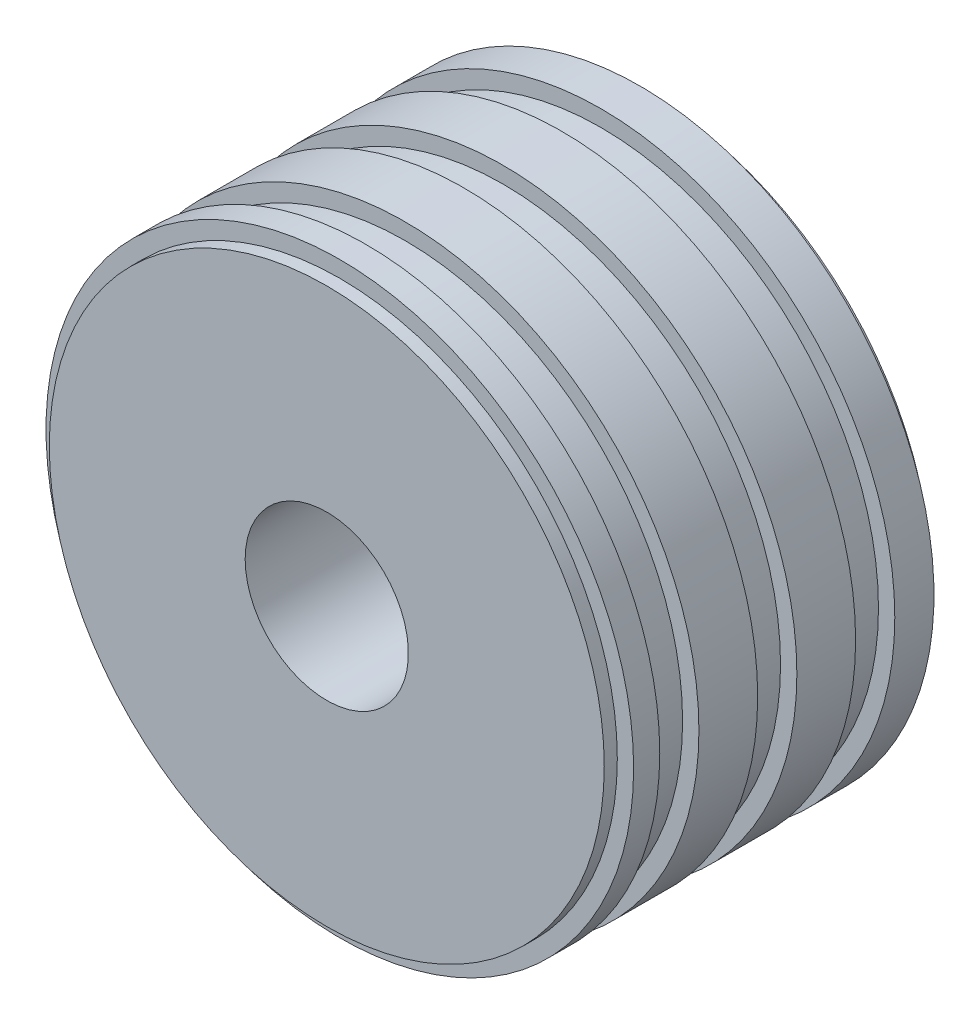
ISO-10303-21;
HEADER;
FILE_DESCRIPTION(('STEP AP214'),'2;1');
FILE_NAME('part.step','',(''),(''),'','','');
FILE_SCHEMA(('AUTOMOTIVE_DESIGN { 1 0 10303 214 1 1 1 1 }'));
ENDSEC;
DATA;
#1=APPLICATION_CONTEXT('core data for automotive mechanical design processes');
#2=APPLICATION_PROTOCOL_DEFINITION('international standard','automotive_design',2000,#1);
#3=PRODUCT_CONTEXT('',#1,'mechanical');
#4=PRODUCT('Part','Part','',(#3));
#5=PRODUCT_RELATED_PRODUCT_CATEGORY('part','',(#4));
#6=PRODUCT_DEFINITION_FORMATION('','',#4);
#7=PRODUCT_DEFINITION_CONTEXT('part definition',#1,'design');
#8=PRODUCT_DEFINITION('design','',#6,#7);
#9=PRODUCT_DEFINITION_SHAPE('','',#8);
#10=(LENGTH_UNIT() NAMED_UNIT(*) SI_UNIT(.MILLI.,.METRE.));
#11=(NAMED_UNIT(*) PLANE_ANGLE_UNIT() SI_UNIT($,.RADIAN.));
#12=(NAMED_UNIT(*) SI_UNIT($,.STERADIAN.) SOLID_ANGLE_UNIT());
#13=UNCERTAINTY_MEASURE_WITH_UNIT(LENGTH_MEASURE(1.E-05),#10,'distance_accuracy_value','');
#14=(GEOMETRIC_REPRESENTATION_CONTEXT(3) GLOBAL_UNCERTAINTY_ASSIGNED_CONTEXT((#13)) GLOBAL_UNIT_ASSIGNED_CONTEXT((#10,
#11,#12)) REPRESENTATION_CONTEXT('',''));
#15=CARTESIAN_POINT('',(0.,0.,0.));
#16=DIRECTION('',(0.,0.,1.));
#17=DIRECTION('',(1.,0.,0.));
#18=AXIS2_PLACEMENT_3D('',#15,#16,#17);
#19=CARTESIAN_POINT('',(0.,0.,50.));
#20=DIRECTION('',(0.,0.,-1.));
#21=DIRECTION('',(-1.,0.,0.));
#22=AXIS2_PLACEMENT_3D('',#19,#20,#21);
#23=CYLINDRICAL_SURFACE('',#22,45.);
#24=CARTESIAN_POINT('',(0.,0.,8.));
#25=DIRECTION('',(0.,0.,1.));
#26=DIRECTION('',(1.,0.,0.));
#27=AXIS2_PLACEMENT_3D('',#24,#25,#26);
#28=CIRCLE('',#27,45.);
#29=CARTESIAN_POINT('',(45.,0.,8.));
#30=VERTEX_POINT('',#29);
#31=EDGE_CURVE('E63',#30,#30,#28,.T.);
#32=ORIENTED_EDGE('',*,*,#31,.F.);
#33=EDGE_LOOP('',(#32));
#34=FACE_BOUND('',#33,.T.);
#35=CARTESIAN_POINT('',(0.,0.,2.));
#36=DIRECTION('',(0.,0.,-1.));
#37=DIRECTION('',(-1.,0.,0.));
#38=AXIS2_PLACEMENT_3D('',#35,#36,#37);
#39=CIRCLE('',#38,45.);
#40=CARTESIAN_POINT('',(-45.,0.,2.));
#41=VERTEX_POINT('',#40);
#42=EDGE_CURVE('E90',#41,#41,#39,.T.);
#43=ORIENTED_EDGE('',*,*,#42,.F.);
#44=EDGE_LOOP('',(#43));
#45=FACE_BOUND('',#44,.T.);
#46=ADVANCED_FACE('F41',(#34,#45),#23,.T.);
#47=CARTESIAN_POINT('',(0.,0.,44.));
#48=DIRECTION('',(0.,0.,1.));
#49=DIRECTION('',(1.,0.,0.));
#50=AXIS2_PLACEMENT_3D('',#47,#48,#49);
#51=CIRCLE('',#50,45.);
#52=CARTESIAN_POINT('',(45.,0.,44.));
#53=VERTEX_POINT('',#52);
#54=EDGE_CURVE('E45',#53,#53,#51,.T.);
#55=ORIENTED_EDGE('',*,*,#54,.T.);
#56=EDGE_LOOP('',(#55));
#57=FACE_BOUND('',#56,.T.);
#58=CARTESIAN_POINT('',(0.,0.,48.));
#59=DIRECTION('',(0.,0.,1.));
#60=DIRECTION('',(1.,0.,0.));
#61=AXIS2_PLACEMENT_3D('',#58,#59,#60);
#62=CIRCLE('',#61,45.);
#63=CARTESIAN_POINT('',(45.,0.,48.));
#64=VERTEX_POINT('',#63);
#65=EDGE_CURVE('E71',#64,#64,#62,.T.);
#66=ORIENTED_EDGE('',*,*,#65,.F.);
#67=EDGE_LOOP('',(#66));
#68=FACE_BOUND('',#67,.T.);
#69=ADVANCED_FACE('F43',(#57,#68),#23,.T.);
#70=CARTESIAN_POINT('',(0.,0.,29.));
#71=DIRECTION('',(0.,0.,1.));
#72=DIRECTION('',(1.,0.,0.));
#73=AXIS2_PLACEMENT_3D('',#70,#71,#72);
#74=CIRCLE('',#73,45.);
#75=CARTESIAN_POINT('',(45.,0.,29.));
#76=VERTEX_POINT('',#75);
#77=EDGE_CURVE('E74',#76,#76,#74,.T.);
#78=ORIENTED_EDGE('',*,*,#77,.T.);
#79=EDGE_LOOP('',(#78));
#80=FACE_BOUND('',#79,.T.);
#81=CARTESIAN_POINT('',(0.,0.,38.));
#82=DIRECTION('',(0.,0.,1.));
#83=DIRECTION('',(1.,0.,0.));
#84=AXIS2_PLACEMENT_3D('',#81,#82,#83);
#85=CIRCLE('',#84,45.);
#86=CARTESIAN_POINT('',(45.,0.,38.));
#87=VERTEX_POINT('',#86);
#88=EDGE_CURVE('E10',#87,#87,#85,.T.);
#89=ORIENTED_EDGE('',*,*,#88,.F.);
#90=EDGE_LOOP('',(#89));
#91=FACE_BOUND('',#90,.T.);
#92=ADVANCED_FACE('F140',(#80,#91),#23,.T.);
#93=CARTESIAN_POINT('',(0.,0.,38.));
#94=DIRECTION('',(0.,0.,1.));
#95=DIRECTION('',(1.,0.,0.));
#96=AXIS2_PLACEMENT_3D('',#93,#94,#95);
#97=PLANE('',#96);
#98=CARTESIAN_POINT('',(0.,0.,38.));
#99=DIRECTION('',(0.,0.,1.));
#100=DIRECTION('',(1.,0.,0.));
#101=AXIS2_PLACEMENT_3D('',#98,#99,#100);
#102=CIRCLE('',#101,42.5);
#103=CARTESIAN_POINT('',(42.5,0.,38.));
#104=VERTEX_POINT('',#103);
#105=EDGE_CURVE('E52',#104,#104,#102,.T.);
#106=ORIENTED_EDGE('',*,*,#105,.F.);
#107=EDGE_LOOP('',(#106));
#108=FACE_BOUND('',#107,.T.);
#109=ORIENTED_EDGE('',*,*,#88,.T.);
#110=EDGE_LOOP('',(#109));
#111=FACE_BOUND('',#110,.T.);
#112=ADVANCED_FACE('F160',(#108,#111),#97,.T.);
#113=CARTESIAN_POINT('',(0.,0.,44.));
#114=DIRECTION('',(0.,0.,1.));
#115=DIRECTION('',(1.,0.,0.));
#116=AXIS2_PLACEMENT_3D('',#113,#114,#115);
#117=PLANE('',#116);
#118=CARTESIAN_POINT('',(0.,0.,44.));
#119=DIRECTION('',(0.,0.,1.));
#120=DIRECTION('',(1.,0.,0.));
#121=AXIS2_PLACEMENT_3D('',#118,#119,#120);
#122=CIRCLE('',#121,42.5);
#123=CARTESIAN_POINT('',(42.5,0.,44.));
#124=VERTEX_POINT('',#123);
#125=EDGE_CURVE('E54',#124,#124,#122,.T.);
#126=ORIENTED_EDGE('',*,*,#125,.T.);
#127=EDGE_LOOP('',(#126));
#128=FACE_BOUND('',#127,.T.);
#129=ORIENTED_EDGE('',*,*,#54,.F.);
#130=EDGE_LOOP('',(#129));
#131=FACE_BOUND('',#130,.T.);
#132=ADVANCED_FACE('F167',(#128,#131),#117,.F.);
#133=CARTESIAN_POINT('',(0.,0.,38.));
#134=DIRECTION('',(0.,0.,1.));
#135=DIRECTION('',(1.,0.,0.));
#136=AXIS2_PLACEMENT_3D('',#133,#134,#135);
#137=CYLINDRICAL_SURFACE('',#136,42.5);
#138=ORIENTED_EDGE('',*,*,#105,.T.);
#139=EDGE_LOOP('',(#138));
#140=FACE_BOUND('',#139,.T.);
#141=ORIENTED_EDGE('',*,*,#125,.F.);
#142=EDGE_LOOP('',(#141));
#143=FACE_BOUND('',#142,.T.);
#144=ADVANCED_FACE('F179',(#140,#143),#137,.T.);
#145=CARTESIAN_POINT('',(0.,0.,23.));
#146=DIRECTION('',(0.,0.,1.));
#147=DIRECTION('',(1.,0.,0.));
#148=AXIS2_PLACEMENT_3D('',#145,#146,#147);
#149=PLANE('',#148);
#150=CARTESIAN_POINT('',(0.,0.,23.));
#151=DIRECTION('',(0.,0.,1.));
#152=DIRECTION('',(1.,0.,0.));
#153=AXIS2_PLACEMENT_3D('',#150,#151,#152);
#154=CIRCLE('',#153,42.5);
#155=CARTESIAN_POINT('',(42.5,0.,23.));
#156=VERTEX_POINT('',#155);
#157=EDGE_CURVE('E77',#156,#156,#154,.T.);
#158=ORIENTED_EDGE('',*,*,#157,.F.);
#159=EDGE_LOOP('',(#158));
#160=FACE_BOUND('',#159,.T.);
#161=CARTESIAN_POINT('',(0.,0.,23.));
#162=DIRECTION('',(0.,0.,1.));
#163=DIRECTION('',(1.,0.,0.));
#164=AXIS2_PLACEMENT_3D('',#161,#162,#163);
#165=CIRCLE('',#164,45.);
#166=CARTESIAN_POINT('',(45.,0.,23.));
#167=VERTEX_POINT('',#166);
#168=EDGE_CURVE('E57',#167,#167,#165,.T.);
#169=ORIENTED_EDGE('',*,*,#168,.T.);
#170=EDGE_LOOP('',(#169));
#171=FACE_BOUND('',#170,.T.);
#172=ADVANCED_FACE('F174',(#160,#171),#149,.T.);
#173=CARTESIAN_POINT('',(0.,0.,29.));
#174=DIRECTION('',(0.,0.,1.));
#175=DIRECTION('',(1.,0.,0.));
#176=AXIS2_PLACEMENT_3D('',#173,#174,#175);
#177=PLANE('',#176);
#178=CARTESIAN_POINT('',(0.,0.,29.));
#179=DIRECTION('',(0.,0.,1.));
#180=DIRECTION('',(1.,0.,0.));
#181=AXIS2_PLACEMENT_3D('',#178,#179,#180);
#182=CIRCLE('',#181,42.5);
#183=CARTESIAN_POINT('',(42.5,0.,29.));
#184=VERTEX_POINT('',#183);
#185=EDGE_CURVE('E67',#184,#184,#182,.T.);
#186=ORIENTED_EDGE('',*,*,#185,.T.);
#187=EDGE_LOOP('',(#186));
#188=FACE_BOUND('',#187,.T.);
#189=ORIENTED_EDGE('',*,*,#77,.F.);
#190=EDGE_LOOP('',(#189));
#191=FACE_BOUND('',#190,.T.);
#192=ADVANCED_FACE('F155',(#188,#191),#177,.F.);
#193=CARTESIAN_POINT('',(0.,0.,23.));
#194=DIRECTION('',(0.,0.,1.));
#195=DIRECTION('',(1.,0.,0.));
#196=AXIS2_PLACEMENT_3D('',#193,#194,#195);
#197=CYLINDRICAL_SURFACE('',#196,42.5);
#198=ORIENTED_EDGE('',*,*,#157,.T.);
#199=EDGE_LOOP('',(#198));
#200=FACE_BOUND('',#199,.T.);
#201=ORIENTED_EDGE('',*,*,#185,.F.);
#202=EDGE_LOOP('',(#201));
#203=FACE_BOUND('',#202,.T.);
#204=ADVANCED_FACE('F146',(#200,#203),#197,.T.);
#205=CARTESIAN_POINT('',(0.,0.,14.));
#206=DIRECTION('',(0.,0.,1.));
#207=DIRECTION('',(1.,0.,0.));
#208=AXIS2_PLACEMENT_3D('',#205,#206,#207);
#209=CIRCLE('',#208,45.);
#210=CARTESIAN_POINT('',(45.,0.,14.));
#211=VERTEX_POINT('',#210);
#212=EDGE_CURVE('E60',#211,#211,#209,.T.);
#213=ORIENTED_EDGE('',*,*,#212,.T.);
#214=EDGE_LOOP('',(#213));
#215=FACE_BOUND('',#214,.T.);
#216=ORIENTED_EDGE('',*,*,#168,.F.);
#217=EDGE_LOOP('',(#216));
#218=FACE_BOUND('',#217,.T.);
#219=ADVANCED_FACE('F135',(#215,#218),#23,.T.);
#220=CARTESIAN_POINT('',(0.,0.,8.));
#221=DIRECTION('',(0.,0.,1.));
#222=DIRECTION('',(1.,0.,0.));
#223=AXIS2_PLACEMENT_3D('',#220,#221,#222);
#224=PLANE('',#223);
#225=CARTESIAN_POINT('',(0.,0.,8.));
#226=DIRECTION('',(0.,0.,1.));
#227=DIRECTION('',(1.,0.,0.));
#228=AXIS2_PLACEMENT_3D('',#225,#226,#227);
#229=CIRCLE('',#228,42.5);
#230=CARTESIAN_POINT('',(42.5,0.,8.));
#231=VERTEX_POINT('',#230);
#232=EDGE_CURVE('E64',#231,#231,#229,.T.);
#233=ORIENTED_EDGE('',*,*,#232,.F.);
#234=EDGE_LOOP('',(#233));
#235=FACE_BOUND('',#234,.T.);
#236=ORIENTED_EDGE('',*,*,#31,.T.);
#237=EDGE_LOOP('',(#236));
#238=FACE_BOUND('',#237,.T.);
#239=ADVANCED_FACE('F145',(#235,#238),#224,.T.);
#240=CARTESIAN_POINT('',(0.,0.,14.));
#241=DIRECTION('',(0.,0.,1.));
#242=DIRECTION('',(1.,0.,0.));
#243=AXIS2_PLACEMENT_3D('',#240,#241,#242);
#244=PLANE('',#243);
#245=CARTESIAN_POINT('',(0.,0.,14.));
#246=DIRECTION('',(0.,0.,1.));
#247=DIRECTION('',(1.,0.,0.));
#248=AXIS2_PLACEMENT_3D('',#245,#246,#247);
#249=CIRCLE('',#248,42.5);
#250=CARTESIAN_POINT('',(42.5,0.,14.));
#251=VERTEX_POINT('',#250);
#252=EDGE_CURVE('E68',#251,#251,#249,.T.);
#253=ORIENTED_EDGE('',*,*,#252,.T.);
#254=EDGE_LOOP('',(#253));
#255=FACE_BOUND('',#254,.T.);
#256=ORIENTED_EDGE('',*,*,#212,.F.);
#257=EDGE_LOOP('',(#256));
#258=FACE_BOUND('',#257,.T.);
#259=ADVANCED_FACE('F152',(#255,#258),#244,.F.);
#260=CARTESIAN_POINT('',(0.,0.,8.));
#261=DIRECTION('',(0.,0.,1.));
#262=DIRECTION('',(1.,0.,0.));
#263=AXIS2_PLACEMENT_3D('',#260,#261,#262);
#264=CYLINDRICAL_SURFACE('',#263,42.5);
#265=ORIENTED_EDGE('',*,*,#232,.T.);
#266=EDGE_LOOP('',(#265));
#267=FACE_BOUND('',#266,.T.);
#268=ORIENTED_EDGE('',*,*,#252,.F.);
#269=EDGE_LOOP('',(#268));
#270=FACE_BOUND('',#269,.T.);
#271=ADVANCED_FACE('F183',(#267,#270),#264,.T.);
#272=CARTESIAN_POINT('',(0.,0.,48.));
#273=DIRECTION('',(0.,0.,1.));
#274=DIRECTION('',(1.,0.,0.));
#275=AXIS2_PLACEMENT_3D('',#272,#273,#274);
#276=PLANE('',#275);
#277=CARTESIAN_POINT('',(0.,0.,48.));
#278=DIRECTION('',(0.,0.,1.));
#279=DIRECTION('',(1.,0.,0.));
#280=AXIS2_PLACEMENT_3D('',#277,#278,#279);
#281=CIRCLE('',#280,42.5);
#282=CARTESIAN_POINT('',(42.5,0.,48.));
#283=VERTEX_POINT('',#282);
#284=EDGE_CURVE('E86',#283,#283,#281,.T.);
#285=ORIENTED_EDGE('',*,*,#284,.F.);
#286=EDGE_LOOP('',(#285));
#287=FACE_BOUND('',#286,.T.);
#288=ORIENTED_EDGE('',*,*,#65,.T.);
#289=EDGE_LOOP('',(#288));
#290=FACE_BOUND('',#289,.T.);
#291=ADVANCED_FACE('F185',(#287,#290),#276,.T.);
#292=CARTESIAN_POINT('',(0.,0.,48.));
#293=DIRECTION('',(0.,0.,1.));
#294=DIRECTION('',(1.,0.,0.));
#295=AXIS2_PLACEMENT_3D('',#292,#293,#294);
#296=CYLINDRICAL_SURFACE('',#295,42.5);
#297=ORIENTED_EDGE('',*,*,#284,.T.);
#298=EDGE_LOOP('',(#297));
#299=FACE_BOUND('',#298,.T.);
#300=CARTESIAN_POINT('',(0.,0.,50.));
#301=DIRECTION('',(0.,0.,1.));
#302=DIRECTION('',(1.,0.,0.));
#303=AXIS2_PLACEMENT_3D('',#300,#301,#302);
#304=CIRCLE('',#303,42.5);
#305=CARTESIAN_POINT('',(42.5,0.,50.));
#306=VERTEX_POINT('',#305);
#307=EDGE_CURVE('E87',#306,#306,#304,.T.);
#308=ORIENTED_EDGE('',*,*,#307,.F.);
#309=EDGE_LOOP('',(#308));
#310=FACE_BOUND('',#309,.T.);
#311=ADVANCED_FACE('F196',(#299,#310),#296,.T.);
#312=CARTESIAN_POINT('',(0.,0.,50.));
#313=DIRECTION('',(0.,0.,1.));
#314=DIRECTION('',(1.,0.,0.));
#315=AXIS2_PLACEMENT_3D('',#312,#313,#314);
#316=PLANE('',#315);
#317=CARTESIAN_POINT('',(0.,0.,50.));
#318=DIRECTION('',(0.,0.,-1.));
#319=DIRECTION('',(-1.,0.,0.));
#320=AXIS2_PLACEMENT_3D('',#317,#318,#319);
#321=CIRCLE('',#320,12.5);
#322=CARTESIAN_POINT('',(-12.5,0.,50.));
#323=VERTEX_POINT('',#322);
#324=EDGE_CURVE('E99',#323,#323,#321,.T.);
#325=ORIENTED_EDGE('',*,*,#324,.T.);
#326=EDGE_LOOP('',(#325));
#327=FACE_BOUND('',#326,.T.);
#328=ORIENTED_EDGE('',*,*,#307,.T.);
#329=EDGE_LOOP('',(#328));
#330=FACE_BOUND('',#329,.T.);
#331=ADVANCED_FACE('F108',(#327,#330),#316,.T.);
#332=CARTESIAN_POINT('',(0.,0.,2.));
#333=DIRECTION('',(0.,0.,-1.));
#334=DIRECTION('',(-1.,0.,0.));
#335=AXIS2_PLACEMENT_3D('',#332,#333,#334);
#336=PLANE('',#335);
#337=CARTESIAN_POINT('',(0.,0.,2.));
#338=DIRECTION('',(0.,0.,-1.));
#339=DIRECTION('',(-1.,0.,0.));
#340=AXIS2_PLACEMENT_3D('',#337,#338,#339);
#341=CIRCLE('',#340,42.5);
#342=CARTESIAN_POINT('',(-42.5,0.,2.));
#343=VERTEX_POINT('',#342);
#344=EDGE_CURVE('E95',#343,#343,#341,.T.);
#345=ORIENTED_EDGE('',*,*,#344,.F.);
#346=EDGE_LOOP('',(#345));
#347=FACE_BOUND('',#346,.T.);
#348=ORIENTED_EDGE('',*,*,#42,.T.);
#349=EDGE_LOOP('',(#348));
#350=FACE_BOUND('',#349,.T.);
#351=ADVANCED_FACE('F124',(#347,#350),#336,.T.);
#352=CARTESIAN_POINT('',(0.,0.,2.));
#353=DIRECTION('',(0.,0.,-1.));
#354=DIRECTION('',(-1.,0.,0.));
#355=AXIS2_PLACEMENT_3D('',#352,#353,#354);
#356=CYLINDRICAL_SURFACE('',#355,42.5);
#357=ORIENTED_EDGE('',*,*,#344,.T.);
#358=EDGE_LOOP('',(#357));
#359=FACE_BOUND('',#358,.T.);
#360=CARTESIAN_POINT('',(0.,0.,0.));
#361=DIRECTION('',(0.,0.,-1.));
#362=DIRECTION('',(-1.,0.,0.));
#363=AXIS2_PLACEMENT_3D('',#360,#361,#362);
#364=CIRCLE('',#363,42.5);
#365=CARTESIAN_POINT('',(-42.5,0.,0.));
#366=VERTEX_POINT('',#365);
#367=EDGE_CURVE('E96',#366,#366,#364,.T.);
#368=ORIENTED_EDGE('',*,*,#367,.F.);
#369=EDGE_LOOP('',(#368));
#370=FACE_BOUND('',#369,.T.);
#371=ADVANCED_FACE('F120',(#359,#370),#356,.T.);
#372=CARTESIAN_POINT('',(0.,0.,0.));
#373=DIRECTION('',(0.,0.,1.));
#374=DIRECTION('',(1.,0.,0.));
#375=AXIS2_PLACEMENT_3D('',#372,#373,#374);
#376=PLANE('',#375);
#377=CARTESIAN_POINT('',(0.,0.,0.));
#378=DIRECTION('',(0.,0.,-1.));
#379=DIRECTION('',(-1.,0.,0.));
#380=AXIS2_PLACEMENT_3D('',#377,#378,#379);
#381=CIRCLE('',#380,12.5);
#382=CARTESIAN_POINT('',(-12.5,0.,0.));
#383=VERTEX_POINT('',#382);
#384=EDGE_CURVE('E102',#383,#383,#381,.T.);
#385=ORIENTED_EDGE('',*,*,#384,.F.);
#386=EDGE_LOOP('',(#385));
#387=FACE_BOUND('',#386,.T.);
#388=ORIENTED_EDGE('',*,*,#367,.T.);
#389=EDGE_LOOP('',(#388));
#390=FACE_BOUND('',#389,.T.);
#391=ADVANCED_FACE('F114',(#387,#390),#376,.F.);
#392=CARTESIAN_POINT('',(0.,0.,50.));
#393=DIRECTION('',(0.,0.,-1.));
#394=DIRECTION('',(-1.,0.,0.));
#395=AXIS2_PLACEMENT_3D('',#392,#393,#394);
#396=CYLINDRICAL_SURFACE('',#395,12.5);
#397=ORIENTED_EDGE('',*,*,#324,.F.);
#398=EDGE_LOOP('',(#397));
#399=FACE_BOUND('',#398,.T.);
#400=ORIENTED_EDGE('',*,*,#384,.T.);
#401=EDGE_LOOP('',(#400));
#402=FACE_BOUND('',#401,.T.);
#403=ADVANCED_FACE('F111',(#399,#402),#396,.F.);
#404=CLOSED_SHELL('',(#46,#69,#92,#112,#132,#144,#172,#192,#204,#219,#239,#259,#271,#291,#311,
#331,#351,#371,#391,#403));
#405=MANIFOLD_SOLID_BREP('B2',#404);
#406=ADVANCED_BREP_SHAPE_REPRESENTATION('',(#18,#405),#14);
#407=SHAPE_DEFINITION_REPRESENTATION(#9,#406);
ENDSEC;
END-ISO-10303-21;
